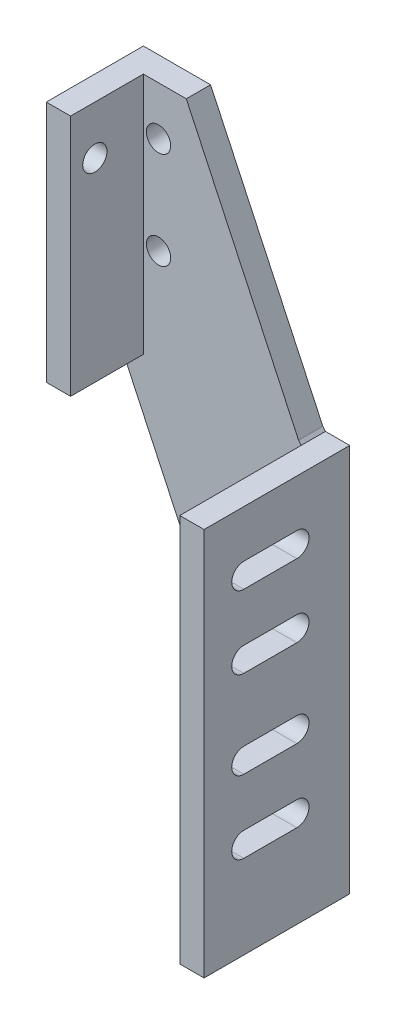
ISO-10303-21;
HEADER;
FILE_DESCRIPTION(('STEP AP214'),'2;1');
FILE_NAME('part.step','',(''),(''),'','','');
FILE_SCHEMA(('AUTOMOTIVE_DESIGN { 1 0 10303 214 1 1 1 1 }'));
ENDSEC;
DATA;
#1=APPLICATION_CONTEXT('core data for automotive mechanical design processes');
#2=APPLICATION_PROTOCOL_DEFINITION('international standard','automotive_design',2000,#1);
#3=PRODUCT_CONTEXT('',#1,'mechanical');
#4=PRODUCT('Part','Part','',(#3));
#5=PRODUCT_RELATED_PRODUCT_CATEGORY('part','',(#4));
#6=PRODUCT_DEFINITION_FORMATION('','',#4);
#7=PRODUCT_DEFINITION_CONTEXT('part definition',#1,'design');
#8=PRODUCT_DEFINITION('design','',#6,#7);
#9=PRODUCT_DEFINITION_SHAPE('','',#8);
#10=(LENGTH_UNIT() NAMED_UNIT(*) SI_UNIT(.MILLI.,.METRE.));
#11=(NAMED_UNIT(*) PLANE_ANGLE_UNIT() SI_UNIT($,.RADIAN.));
#12=(NAMED_UNIT(*) SI_UNIT($,.STERADIAN.) SOLID_ANGLE_UNIT());
#13=UNCERTAINTY_MEASURE_WITH_UNIT(LENGTH_MEASURE(1.E-05),#10,'distance_accuracy_value','');
#14=(GEOMETRIC_REPRESENTATION_CONTEXT(3) GLOBAL_UNCERTAINTY_ASSIGNED_CONTEXT((#13)) GLOBAL_UNIT_ASSIGNED_CONTEXT((#10,
#11,#12)) REPRESENTATION_CONTEXT('',''));
#15=CARTESIAN_POINT('',(0.,0.,0.));
#16=DIRECTION('',(0.,0.,1.));
#17=DIRECTION('',(1.,0.,0.));
#18=AXIS2_PLACEMENT_3D('',#15,#16,#17);
#19=CARTESIAN_POINT('',(-106.588300915185,-1.66039880784868,12.7));
#20=DIRECTION('',(0.,0.,1.));
#21=DIRECTION('',(1.,0.,0.));
#22=AXIS2_PLACEMENT_3D('',#19,#20,#21);
#23=PLANE('',#22);
#24=CARTESIAN_POINT('',(-85.963500915185,99.9476380283201,12.7));
#25=DIRECTION('',(0.,0.,1.));
#26=DIRECTION('',(1.,0.,0.));
#27=AXIS2_PLACEMENT_3D('',#24,#25,#26);
#28=CIRCLE('',#27,6.34999999999999);
#29=CARTESIAN_POINT('',(-79.613500915185,99.9476380283201,12.7));
#30=VERTEX_POINT('',#29);
#31=EDGE_CURVE('E49',#30,#30,#28,.T.);
#32=ORIENTED_EDGE('',*,*,#31,.F.);
#33=EDGE_LOOP('',(#32));
#34=FACE_BOUND('',#33,.T.);
#35=CARTESIAN_POINT('',(-85.963500915185,49.1476380283201,12.7));
#36=DIRECTION('',(0.,0.,1.));
#37=DIRECTION('',(1.,0.,0.));
#38=AXIS2_PLACEMENT_3D('',#35,#36,#37);
#39=CIRCLE('',#38,6.34999999999999);
#40=CARTESIAN_POINT('',(-79.613500915185,49.1476380283201,12.7));
#41=VERTEX_POINT('',#40);
#42=EDGE_CURVE('E364',#41,#41,#39,.T.);
#43=ORIENTED_EDGE('',*,*,#42,.F.);
#44=EDGE_LOOP('',(#43));
#45=FACE_BOUND('',#44,.T.);
#46=DIRECTION('',(0.424357467855112,-0.905494748452799,0.));
#47=VECTOR('',#46,1.);
#48=CARTESIAN_POINT('',(-106.588300915185,-1.65236197167989,12.7));
#49=LINE('',#48,#47);
#50=CARTESIAN_POINT('',(-106.588300915185,-1.65236197167989,12.7));
#51=VERTEX_POINT('',#50);
#52=CARTESIAN_POINT('',(-11.355448259828,-204.860398807849,12.7));
#53=VERTEX_POINT('',#52);
#54=EDGE_CURVE('E429',#51,#53,#49,.T.);
#55=ORIENTED_EDGE('',*,*,#54,.T.);
#56=DIRECTION('',(0.,-1.,0.));
#57=VECTOR('',#56,1.);
#58=CARTESIAN_POINT('',(-11.355448259828,-204.860398807849,12.7));
#59=LINE('',#58,#57);
#60=CARTESIAN_POINT('',(-11.355448259828,-1.66039880784869,12.7));
#61=VERTEX_POINT('',#60);
#62=EDGE_CURVE('E371',#61,#53,#59,.T.);
#63=ORIENTED_EDGE('',*,*,#62,.F.);
#64=DIRECTION('',(-0.62931680009807,0.77714886933864,0.));
#65=VECTOR('',#64,1.);
#66=CARTESIAN_POINT('',(-11.355448259828,-1.66039880784869,12.7));
#67=LINE('',#66,#65);
#68=CARTESIAN_POINT('',(-12.7,0.,12.7));
#69=VERTEX_POINT('',#68);
#70=EDGE_CURVE('E475',#61,#69,#67,.T.);
#71=ORIENTED_EDGE('',*,*,#70,.T.);
#72=DIRECTION('',(-0.424357467855125,0.905494748452793,0.));
#73=VECTOR('',#72,1.);
#74=CARTESIAN_POINT('',(-12.7,0.,12.7));
#75=LINE('',#74,#73);
#76=CARTESIAN_POINT('',(-71.443804275185,125.34763802832,12.7));
#77=VERTEX_POINT('',#76);
#78=EDGE_CURVE('E477',#69,#77,#75,.T.);
#79=ORIENTED_EDGE('',*,*,#78,.T.);
#80=DIRECTION('',(-1.,0.,0.));
#81=VECTOR('',#80,1.);
#82=CARTESIAN_POINT('',(-71.443804275185,125.34763802832,12.7));
#83=LINE('',#82,#81);
#84=CARTESIAN_POINT('',(-93.888300915185,125.34763802832,12.7));
#85=VERTEX_POINT('',#84);
#86=EDGE_CURVE('E413',#77,#85,#83,.T.);
#87=ORIENTED_EDGE('',*,*,#86,.T.);
#88=DIRECTION('',(0.,1.,0.));
#89=VECTOR('',#88,1.);
#90=CARTESIAN_POINT('',(-93.888300915185,125.34763802832,12.7));
#91=LINE('',#90,#89);
#92=CARTESIAN_POINT('',(-93.888300915185,-1.65236197167989,12.7));
#93=VERTEX_POINT('',#92);
#94=EDGE_CURVE('E395',#93,#85,#91,.T.);
#95=ORIENTED_EDGE('',*,*,#94,.F.);
#96=DIRECTION('',(1.,0.,0.));
#97=VECTOR('',#96,1.);
#98=CARTESIAN_POINT('',(-106.588300915185,-1.65236197167989,12.7));
#99=LINE('',#98,#97);
#100=EDGE_CURVE('E390',#51,#93,#99,.T.);
#101=ORIENTED_EDGE('',*,*,#100,.F.);
#102=EDGE_LOOP('',(#55,#63,#71,#79,#87,#95,#101));
#103=FACE_BOUND('',#102,.T.);
#104=ADVANCED_FACE('F45',(#34,#45,#103),#23,.T.);
#105=CARTESIAN_POINT('',(1.34455174017202,-1.66039880784868,12.7));
#106=DIRECTION('',(0.,-1.,0.));
#107=DIRECTION('',(1.,0.,0.));
#108=AXIS2_PLACEMENT_3D('',#105,#106,#107);
#109=PLANE('',#108);
#110=DIRECTION('',(-1.,0.,0.));
#111=VECTOR('',#110,1.);
#112=CARTESIAN_POINT('',(1.34455174017202,-1.66039880784868,0.));
#113=LINE('',#112,#111);
#114=CARTESIAN_POINT('',(1.34455174017202,-1.66039880784868,0.));
#115=VERTEX_POINT('',#114);
#116=CARTESIAN_POINT('',(-11.355448259828,-1.66039880784869,0.));
#117=VERTEX_POINT('',#116);
#118=EDGE_CURVE('E469',#115,#117,#113,.T.);
#119=ORIENTED_EDGE('',*,*,#118,.T.);
#120=DIRECTION('',(0.,0.,-1.));
#121=VECTOR('',#120,1.);
#122=CARTESIAN_POINT('',(-11.355448259828,-1.66039880784869,12.7));
#123=LINE('',#122,#121);
#124=EDGE_CURVE('E13',#61,#117,#123,.T.);
#125=ORIENTED_EDGE('',*,*,#124,.F.);
#126=DIRECTION('',(0.,0.,-1.));
#127=VECTOR('',#126,1.);
#128=CARTESIAN_POINT('',(-11.355448259828,-1.66039880784869,76.2));
#129=LINE('',#128,#127);
#130=CARTESIAN_POINT('',(-11.355448259828,-1.66039880784869,76.2));
#131=VERTEX_POINT('',#130);
#132=EDGE_CURVE('E387',#131,#61,#129,.T.);
#133=ORIENTED_EDGE('',*,*,#132,.F.);
#134=DIRECTION('',(-1.,0.,0.));
#135=VECTOR('',#134,1.);
#136=CARTESIAN_POINT('',(1.34455174017202,-1.66039880784869,76.2));
#137=LINE('',#136,#135);
#138=CARTESIAN_POINT('',(1.34455174017202,-1.66039880784869,76.2));
#139=VERTEX_POINT('',#138);
#140=EDGE_CURVE('E375',#139,#131,#137,.T.);
#141=ORIENTED_EDGE('',*,*,#140,.F.);
#142=DIRECTION('',(0.,0.,-1.));
#143=VECTOR('',#142,1.);
#144=CARTESIAN_POINT('',(1.34455174017202,-1.66039880784868,12.7));
#145=LINE('',#144,#143);
#146=EDGE_CURVE('E436',#139,#115,#145,.T.);
#147=ORIENTED_EDGE('',*,*,#146,.T.);
#148=EDGE_LOOP('',(#119,#125,#133,#141,#147));
#149=FACE_BOUND('',#148,.T.);
#150=ADVANCED_FACE('F47',(#149),#109,.F.);
#151=CARTESIAN_POINT('',(-11.355448259828,-1.66039880784869,12.7));
#152=DIRECTION('',(-0.77714886933864,-0.629316800098069,0.));
#153=DIRECTION('',(0.62931680009807,-0.77714886933864,0.));
#154=AXIS2_PLACEMENT_3D('',#151,#152,#153);
#155=PLANE('',#154);
#156=DIRECTION('',(-0.62931680009807,0.77714886933864,0.));
#157=VECTOR('',#156,1.);
#158=CARTESIAN_POINT('',(-11.355448259828,-1.66039880784869,0.));
#159=LINE('',#158,#157);
#160=CARTESIAN_POINT('',(-12.7,0.,0.));
#161=VERTEX_POINT('',#160);
#162=EDGE_CURVE('E473',#117,#161,#159,.T.);
#163=ORIENTED_EDGE('',*,*,#162,.T.);
#164=DIRECTION('',(0.,0.,-1.));
#165=VECTOR('',#164,1.);
#166=CARTESIAN_POINT('',(-12.7,0.,12.7));
#167=LINE('',#166,#165);
#168=EDGE_CURVE('E54',#69,#161,#167,.T.);
#169=ORIENTED_EDGE('',*,*,#168,.F.);
#170=ORIENTED_EDGE('',*,*,#70,.F.);
#171=ORIENTED_EDGE('',*,*,#124,.T.);
#172=EDGE_LOOP('',(#163,#169,#170,#171));
#173=FACE_BOUND('',#172,.T.);
#174=ADVANCED_FACE('F471',(#173),#155,.F.);
#175=CARTESIAN_POINT('',(-12.7,0.,12.7));
#176=DIRECTION('',(-0.905494748452793,-0.424357467855125,0.));
#177=DIRECTION('',(0.424357467855125,-0.905494748452793,0.));
#178=AXIS2_PLACEMENT_3D('',#175,#176,#177);
#179=PLANE('',#178);
#180=DIRECTION('',(-0.424357467855125,0.905494748452793,0.));
#181=VECTOR('',#180,1.);
#182=CARTESIAN_POINT('',(-12.7,0.,0.));
#183=LINE('',#182,#181);
#184=CARTESIAN_POINT('',(-71.443804275185,125.34763802832,0.));
#185=VERTEX_POINT('',#184);
#186=EDGE_CURVE('E487',#161,#185,#183,.T.);
#187=ORIENTED_EDGE('',*,*,#186,.T.);
#188=DIRECTION('',(0.,0.,-1.));
#189=VECTOR('',#188,1.);
#190=CARTESIAN_POINT('',(-71.443804275185,125.34763802832,12.7));
#191=LINE('',#190,#189);
#192=EDGE_CURVE('E500',#77,#185,#191,.T.);
#193=ORIENTED_EDGE('',*,*,#192,.F.);
#194=ORIENTED_EDGE('',*,*,#78,.F.);
#195=ORIENTED_EDGE('',*,*,#168,.T.);
#196=EDGE_LOOP('',(#187,#193,#194,#195));
#197=FACE_BOUND('',#196,.T.);
#198=ADVANCED_FACE('F505',(#197),#179,.F.);
#199=CARTESIAN_POINT('',(-71.443804275185,125.34763802832,12.7));
#200=DIRECTION('',(0.,-1.,0.));
#201=DIRECTION('',(0.,0.,-1.));
#202=AXIS2_PLACEMENT_3D('',#199,#200,#201);
#203=PLANE('',#202);
#204=DIRECTION('',(-1.,0.,0.));
#205=VECTOR('',#204,1.);
#206=CARTESIAN_POINT('',(-71.443804275185,125.34763802832,0.));
#207=LINE('',#206,#205);
#208=CARTESIAN_POINT('',(-106.588300915185,125.34763802832,0.));
#209=VERTEX_POINT('',#208);
#210=EDGE_CURVE('E489',#185,#209,#207,.T.);
#211=ORIENTED_EDGE('',*,*,#210,.T.);
#212=DIRECTION('',(0.,0.,-1.));
#213=VECTOR('',#212,1.);
#214=CARTESIAN_POINT('',(-106.588300915185,125.34763802832,12.7));
#215=LINE('',#214,#213);
#216=CARTESIAN_POINT('',(-106.588300915185,125.34763802832,50.8));
#217=VERTEX_POINT('',#216);
#218=EDGE_CURVE('E497',#217,#209,#215,.T.);
#219=ORIENTED_EDGE('',*,*,#218,.F.);
#220=DIRECTION('',(-1.,0.,0.));
#221=VECTOR('',#220,1.);
#222=CARTESIAN_POINT('',(-106.588300915185,125.34763802832,50.8));
#223=LINE('',#222,#221);
#224=CARTESIAN_POINT('',(-93.888300915185,125.34763802832,50.8));
#225=VERTEX_POINT('',#224);
#226=EDGE_CURVE('E399',#225,#217,#223,.T.);
#227=ORIENTED_EDGE('',*,*,#226,.F.);
#228=DIRECTION('',(0.,0.,-1.));
#229=VECTOR('',#228,1.);
#230=CARTESIAN_POINT('',(-93.888300915185,125.34763802832,50.8));
#231=LINE('',#230,#229);
#232=EDGE_CURVE('E402',#225,#85,#231,.T.);
#233=ORIENTED_EDGE('',*,*,#232,.T.);
#234=ORIENTED_EDGE('',*,*,#86,.F.);
#235=ORIENTED_EDGE('',*,*,#192,.T.);
#236=EDGE_LOOP('',(#211,#219,#227,#233,#234,#235));
#237=FACE_BOUND('',#236,.T.);
#238=ADVANCED_FACE('F512',(#237),#203,.F.);
#239=CARTESIAN_POINT('',(-106.588300915185,125.34763802832,12.7));
#240=DIRECTION('',(1.,0.,0.));
#241=DIRECTION('',(0.,1.,0.));
#242=AXIS2_PLACEMENT_3D('',#239,#240,#241);
#243=PLANE('',#242);
#244=CARTESIAN_POINT('',(-106.588300915185,99.9476380283201,38.1));
#245=DIRECTION('',(-1.,0.,0.));
#246=DIRECTION('',(0.,0.,1.));
#247=AXIS2_PLACEMENT_3D('',#244,#245,#246);
#248=CIRCLE('',#247,6.34999999999999);
#249=CARTESIAN_POINT('',(-106.588300915185,99.9476380283201,44.45));
#250=VERTEX_POINT('',#249);
#251=EDGE_CURVE('E365',#250,#250,#248,.T.);
#252=ORIENTED_EDGE('',*,*,#251,.F.);
#253=EDGE_LOOP('',(#252));
#254=FACE_BOUND('',#253,.T.);
#255=DIRECTION('',(0.,-1.,0.));
#256=VECTOR('',#255,1.);
#257=CARTESIAN_POINT('',(-106.588300915185,125.34763802832,0.));
#258=LINE('',#257,#256);
#259=CARTESIAN_POINT('',(-106.588300915185,-1.65236197167989,0.));
#260=VERTEX_POINT('',#259);
#261=EDGE_CURVE('E491',#209,#260,#258,.T.);
#262=ORIENTED_EDGE('',*,*,#261,.T.);
#263=DIRECTION('',(0.,0.,-1.));
#264=VECTOR('',#263,1.);
#265=CARTESIAN_POINT('',(-106.588300915185,-1.65236197167989,12.7));
#266=LINE('',#265,#264);
#267=EDGE_CURVE('E445',#51,#260,#266,.T.);
#268=ORIENTED_EDGE('',*,*,#267,.F.);
#269=DIRECTION('',(0.,0.,-1.));
#270=VECTOR('',#269,1.);
#271=CARTESIAN_POINT('',(-106.588300915185,-1.65236197167989,50.8));
#272=LINE('',#271,#270);
#273=CARTESIAN_POINT('',(-106.588300915185,-1.65236197167989,50.8));
#274=VERTEX_POINT('',#273);
#275=EDGE_CURVE('E482',#274,#51,#272,.T.);
#276=ORIENTED_EDGE('',*,*,#275,.F.);
#277=DIRECTION('',(0.,-1.,0.));
#278=VECTOR('',#277,1.);
#279=CARTESIAN_POINT('',(-106.588300915185,125.34763802832,50.8));
#280=LINE('',#279,#278);
#281=EDGE_CURVE('E391',#217,#274,#280,.T.);
#282=ORIENTED_EDGE('',*,*,#281,.F.);
#283=ORIENTED_EDGE('',*,*,#218,.T.);
#284=EDGE_LOOP('',(#262,#268,#276,#282,#283));
#285=FACE_BOUND('',#284,.T.);
#286=ADVANCED_FACE('F517',(#254,#285),#243,.F.);
#287=CARTESIAN_POINT('',(-106.588300915185,-1.65236197167989,12.7));
#288=DIRECTION('',(0.905494748452799,0.424357467855112,0.));
#289=DIRECTION('',(-0.424357467855112,0.905494748452799,0.));
#290=AXIS2_PLACEMENT_3D('',#287,#288,#289);
#291=PLANE('',#290);
#292=DIRECTION('',(0.424357467855112,-0.905494748452799,0.));
#293=VECTOR('',#292,1.);
#294=CARTESIAN_POINT('',(-106.588300915185,-1.65236197167989,0.));
#295=LINE('',#294,#293);
#296=CARTESIAN_POINT('',(-11.355448259828,-204.860398807849,0.));
#297=VERTEX_POINT('',#296);
#298=EDGE_CURVE('E442',#260,#297,#295,.T.);
#299=ORIENTED_EDGE('',*,*,#298,.T.);
#300=DIRECTION('',(0.,0.,-1.));
#301=VECTOR('',#300,1.);
#302=CARTESIAN_POINT('',(-11.355448259828,-204.860398807849,12.7));
#303=LINE('',#302,#301);
#304=EDGE_CURVE('E439',#53,#297,#303,.T.);
#305=ORIENTED_EDGE('',*,*,#304,.F.);
#306=ORIENTED_EDGE('',*,*,#54,.F.);
#307=ORIENTED_EDGE('',*,*,#267,.T.);
#308=EDGE_LOOP('',(#299,#305,#306,#307));
#309=FACE_BOUND('',#308,.T.);
#310=ADVANCED_FACE('F440',(#309),#291,.F.);
#311=CARTESIAN_POINT('',(-11.355448259828,-204.860398807849,12.7));
#312=DIRECTION('',(0.,1.,0.));
#313=DIRECTION('',(0.,0.,1.));
#314=AXIS2_PLACEMENT_3D('',#311,#312,#313);
#315=PLANE('',#314);
#316=DIRECTION('',(1.,0.,0.));
#317=VECTOR('',#316,1.);
#318=CARTESIAN_POINT('',(-11.355448259828,-204.860398807849,0.));
#319=LINE('',#318,#317);
#320=CARTESIAN_POINT('',(1.34455174017202,-204.860398807849,0.));
#321=VERTEX_POINT('',#320);
#322=EDGE_CURVE('E480',#297,#321,#319,.T.);
#323=ORIENTED_EDGE('',*,*,#322,.T.);
#324=DIRECTION('',(0.,0.,-1.));
#325=VECTOR('',#324,1.);
#326=CARTESIAN_POINT('',(1.34455174017202,-204.860398807849,12.7));
#327=LINE('',#326,#325);
#328=CARTESIAN_POINT('',(1.34455174017202,-204.860398807849,76.2));
#329=VERTEX_POINT('',#328);
#330=EDGE_CURVE('E446',#329,#321,#327,.T.);
#331=ORIENTED_EDGE('',*,*,#330,.F.);
#332=DIRECTION('',(1.,0.,0.));
#333=VECTOR('',#332,1.);
#334=CARTESIAN_POINT('',(1.34455174017202,-204.860398807849,76.2));
#335=LINE('',#334,#333);
#336=CARTESIAN_POINT('',(-11.355448259828,-204.860398807849,76.2));
#337=VERTEX_POINT('',#336);
#338=EDGE_CURVE('E379',#337,#329,#335,.T.);
#339=ORIENTED_EDGE('',*,*,#338,.F.);
#340=DIRECTION('',(0.,0.,-1.));
#341=VECTOR('',#340,1.);
#342=CARTESIAN_POINT('',(-11.355448259828,-204.860398807849,76.2));
#343=LINE('',#342,#341);
#344=EDGE_CURVE('E382',#337,#53,#343,.T.);
#345=ORIENTED_EDGE('',*,*,#344,.T.);
#346=ORIENTED_EDGE('',*,*,#304,.T.);
#347=EDGE_LOOP('',(#323,#331,#339,#345,#346));
#348=FACE_BOUND('',#347,.T.);
#349=ADVANCED_FACE('F453',(#348),#315,.F.);
#350=CARTESIAN_POINT('',(1.34455174017202,-204.860398807849,12.7));
#351=DIRECTION('',(-1.,0.,0.));
#352=DIRECTION('',(0.,0.,1.));
#353=AXIS2_PLACEMENT_3D('',#350,#351,#352);
#354=PLANE('',#353);
#355=DIRECTION('',(0.,0.,-1.));
#356=VECTOR('',#355,1.);
#357=CARTESIAN_POINT('',(1.34455174017202,-122.945398807849,27.6450635819993));
#358=LINE('',#357,#356);
#359=CARTESIAN_POINT('',(1.34455174017202,-122.945398807849,55.3719999999992));
#360=VERTEX_POINT('',#359);
#361=CARTESIAN_POINT('',(1.34455174017202,-122.945398807849,27.6450635819993));
#362=VERTEX_POINT('',#361);
#363=EDGE_CURVE('E251',#360,#362,#358,.T.);
#364=ORIENTED_EDGE('',*,*,#363,.F.);
#365=CARTESIAN_POINT('',(1.34455174017202,-116.595398807849,55.3719999999993));
#366=DIRECTION('',(1.,0.,0.));
#367=DIRECTION('',(0.,0.,-1.));
#368=AXIS2_PLACEMENT_3D('',#365,#366,#367);
#369=CIRCLE('',#368,6.34999999999999);
#370=CARTESIAN_POINT('',(1.34455174017202,-110.245398807849,55.3719999999993));
#371=VERTEX_POINT('',#370);
#372=EDGE_CURVE('E62',#371,#360,#369,.T.);
#373=ORIENTED_EDGE('',*,*,#372,.F.);
#374=DIRECTION('',(0.,0.,1.));
#375=VECTOR('',#374,1.);
#376=CARTESIAN_POINT('',(1.34455174017202,-110.245398807849,55.3719999999993));
#377=LINE('',#376,#375);
#378=CARTESIAN_POINT('',(1.34455174017202,-110.245398807849,27.6450635819993));
#379=VERTEX_POINT('',#378);
#380=EDGE_CURVE('E237',#379,#371,#377,.T.);
#381=ORIENTED_EDGE('',*,*,#380,.F.);
#382=CARTESIAN_POINT('',(1.34455174017202,-116.595398807849,27.6450635819993));
#383=DIRECTION('',(1.,0.,0.));
#384=DIRECTION('',(0.,0.,-1.));
#385=AXIS2_PLACEMENT_3D('',#382,#383,#384);
#386=CIRCLE('',#385,6.34999999999999);
#387=EDGE_CURVE('E257',#362,#379,#386,.T.);
#388=ORIENTED_EDGE('',*,*,#387,.F.);
#389=EDGE_LOOP('',(#364,#373,#381,#388));
#390=FACE_BOUND('',#389,.T.);
#391=DIRECTION('',(0.,0.,-1.));
#392=VECTOR('',#391,1.);
#393=CARTESIAN_POINT('',(1.34455174017202,-161.045398807849,27.6450635819991));
#394=LINE('',#393,#392);
#395=CARTESIAN_POINT('',(1.34455174017202,-161.045398807849,55.3719999999991));
#396=VERTEX_POINT('',#395);
#397=CARTESIAN_POINT('',(1.34455174017202,-161.045398807849,27.6450635819991));
#398=VERTEX_POINT('',#397);
#399=EDGE_CURVE('E275',#396,#398,#394,.T.);
#400=ORIENTED_EDGE('',*,*,#399,.F.);
#401=CARTESIAN_POINT('',(1.34455174017202,-154.695398807849,55.3719999999991));
#402=DIRECTION('',(1.,0.,0.));
#403=DIRECTION('',(0.,0.,-1.));
#404=AXIS2_PLACEMENT_3D('',#401,#402,#403);
#405=CIRCLE('',#404,6.34999999999999);
#406=CARTESIAN_POINT('',(1.34455174017202,-148.345398807849,55.3719999999991));
#407=VERTEX_POINT('',#406);
#408=EDGE_CURVE('E273',#407,#396,#405,.T.);
#409=ORIENTED_EDGE('',*,*,#408,.F.);
#410=DIRECTION('',(0.,0.,1.));
#411=VECTOR('',#410,1.);
#412=CARTESIAN_POINT('',(1.34455174017202,-148.345398807849,55.3719999999991));
#413=LINE('',#412,#411);
#414=CARTESIAN_POINT('',(1.34455174017202,-148.345398807849,27.6450635819991));
#415=VERTEX_POINT('',#414);
#416=EDGE_CURVE('E281',#415,#407,#413,.T.);
#417=ORIENTED_EDGE('',*,*,#416,.F.);
#418=CARTESIAN_POINT('',(1.34455174017202,-154.695398807849,27.6450635819991));
#419=DIRECTION('',(1.,0.,0.));
#420=DIRECTION('',(0.,0.,-1.));
#421=AXIS2_PLACEMENT_3D('',#418,#419,#420);
#422=CIRCLE('',#421,6.34999999999999);
#423=EDGE_CURVE('E278',#398,#415,#422,.T.);
#424=ORIENTED_EDGE('',*,*,#423,.F.);
#425=EDGE_LOOP('',(#400,#409,#417,#424));
#426=FACE_BOUND('',#425,.T.);
#427=DIRECTION('',(0.,0.,-1.));
#428=VECTOR('',#427,1.);
#429=CARTESIAN_POINT('',(1.34455174017202,-39.1253988078487,27.6450635820001));
#430=LINE('',#429,#428);
#431=CARTESIAN_POINT('',(1.34455174017202,-39.1253988078487,55.3720000000001));
#432=VERTEX_POINT('',#431);
#433=CARTESIAN_POINT('',(1.34455174017202,-39.1253988078487,27.6450635820002));
#434=VERTEX_POINT('',#433);
#435=EDGE_CURVE('E306',#432,#434,#430,.T.);
#436=ORIENTED_EDGE('',*,*,#435,.F.);
#437=CARTESIAN_POINT('',(1.34455174017202,-32.7753988078487,55.3720000000001));
#438=DIRECTION('',(1.,0.,0.));
#439=DIRECTION('',(0.,0.,-1.));
#440=AXIS2_PLACEMENT_3D('',#437,#438,#439);
#441=CIRCLE('',#440,6.34999999999999);
#442=CARTESIAN_POINT('',(1.34455174017202,-26.4253988078487,55.3720000000001));
#443=VERTEX_POINT('',#442);
#444=EDGE_CURVE('E304',#443,#432,#441,.T.);
#445=ORIENTED_EDGE('',*,*,#444,.F.);
#446=DIRECTION('',(0.,0.,1.));
#447=VECTOR('',#446,1.);
#448=CARTESIAN_POINT('',(1.34455174017202,-26.4253988078487,55.3720000000001));
#449=LINE('',#448,#447);
#450=CARTESIAN_POINT('',(1.34455174017202,-26.4253988078487,27.6450635820001));
#451=VERTEX_POINT('',#450);
#452=EDGE_CURVE('E312',#451,#443,#449,.T.);
#453=ORIENTED_EDGE('',*,*,#452,.F.);
#454=CARTESIAN_POINT('',(1.34455174017202,-32.7753988078487,27.6450635820001));
#455=DIRECTION('',(1.,0.,0.));
#456=DIRECTION('',(0.,0.,-1.));
#457=AXIS2_PLACEMENT_3D('',#454,#455,#456);
#458=CIRCLE('',#457,6.34999999999999);
#459=EDGE_CURVE('E309',#434,#451,#458,.T.);
#460=ORIENTED_EDGE('',*,*,#459,.F.);
#461=EDGE_LOOP('',(#436,#445,#453,#460));
#462=FACE_BOUND('',#461,.T.);
#463=DIRECTION('',(0.,0.,-1.));
#464=VECTOR('',#463,1.);
#465=CARTESIAN_POINT('',(1.34455174017202,-77.2253988078487,27.645063582));
#466=LINE('',#465,#464);
#467=CARTESIAN_POINT('',(1.34455174017202,-77.2253988078487,55.372));
#468=VERTEX_POINT('',#467);
#469=CARTESIAN_POINT('',(1.34455174017202,-77.2253988078487,27.645063582));
#470=VERTEX_POINT('',#469);
#471=EDGE_CURVE('E337',#468,#470,#466,.T.);
#472=ORIENTED_EDGE('',*,*,#471,.F.);
#473=CARTESIAN_POINT('',(1.34455174017202,-70.8753988078487,55.372));
#474=DIRECTION('',(1.,0.,0.));
#475=DIRECTION('',(0.,0.,-1.));
#476=AXIS2_PLACEMENT_3D('',#473,#474,#475);
#477=CIRCLE('',#476,6.34999999999999);
#478=CARTESIAN_POINT('',(1.34455174017202,-64.5253988078487,55.372));
#479=VERTEX_POINT('',#478);
#480=EDGE_CURVE('E335',#479,#468,#477,.T.);
#481=ORIENTED_EDGE('',*,*,#480,.F.);
#482=DIRECTION('',(0.,0.,1.));
#483=VECTOR('',#482,1.);
#484=CARTESIAN_POINT('',(1.34455174017202,-64.5253988078487,55.372));
#485=LINE('',#484,#483);
#486=CARTESIAN_POINT('',(1.34455174017202,-64.5253988078487,27.645063582));
#487=VERTEX_POINT('',#486);
#488=EDGE_CURVE('E343',#487,#479,#485,.T.);
#489=ORIENTED_EDGE('',*,*,#488,.F.);
#490=CARTESIAN_POINT('',(1.34455174017202,-70.8753988078487,27.645063582));
#491=DIRECTION('',(1.,0.,0.));
#492=DIRECTION('',(0.,0.,-1.));
#493=AXIS2_PLACEMENT_3D('',#490,#491,#492);
#494=CIRCLE('',#493,6.34999999999999);
#495=EDGE_CURVE('E340',#470,#487,#494,.T.);
#496=ORIENTED_EDGE('',*,*,#495,.F.);
#497=EDGE_LOOP('',(#472,#481,#489,#496));
#498=FACE_BOUND('',#497,.T.);
#499=DIRECTION('',(0.,1.,0.));
#500=VECTOR('',#499,1.);
#501=CARTESIAN_POINT('',(1.34455174017202,-204.860398807849,0.));
#502=LINE('',#501,#500);
#503=EDGE_CURVE('E463',#321,#115,#502,.T.);
#504=ORIENTED_EDGE('',*,*,#503,.T.);
#505=ORIENTED_EDGE('',*,*,#146,.F.);
#506=DIRECTION('',(0.,1.,0.));
#507=VECTOR('',#506,1.);
#508=CARTESIAN_POINT('',(1.34455174017202,-204.860398807849,76.2));
#509=LINE('',#508,#507);
#510=EDGE_CURVE('E372',#329,#139,#509,.T.);
#511=ORIENTED_EDGE('',*,*,#510,.F.);
#512=ORIENTED_EDGE('',*,*,#330,.T.);
#513=EDGE_LOOP('',(#504,#505,#511,#512));
#514=FACE_BOUND('',#513,.T.);
#515=ADVANCED_FACE('F459',(#390,#426,#462,#498,#514),#354,.F.);
#516=CARTESIAN_POINT('',(-106.588300915185,-1.66039880784868,0.));
#517=DIRECTION('',(0.,0.,1.));
#518=DIRECTION('',(1.,0.,0.));
#519=AXIS2_PLACEMENT_3D('',#516,#517,#518);
#520=PLANE('',#519);
#521=CARTESIAN_POINT('',(-85.963500915185,99.9476380283201,0.));
#522=DIRECTION('',(0.,0.,-1.));
#523=DIRECTION('',(-1.,0.,0.));
#524=AXIS2_PLACEMENT_3D('',#521,#522,#523);
#525=CIRCLE('',#524,6.34999999999999);
#526=CARTESIAN_POINT('',(-92.313500915185,99.9476380283201,0.));
#527=VERTEX_POINT('',#526);
#528=EDGE_CURVE('E358',#527,#527,#525,.T.);
#529=ORIENTED_EDGE('',*,*,#528,.F.);
#530=EDGE_LOOP('',(#529));
#531=FACE_BOUND('',#530,.T.);
#532=CARTESIAN_POINT('',(-85.963500915185,49.1476380283201,0.));
#533=DIRECTION('',(0.,0.,-1.));
#534=DIRECTION('',(-1.,0.,0.));
#535=AXIS2_PLACEMENT_3D('',#532,#533,#534);
#536=CIRCLE('',#535,6.34999999999999);
#537=CARTESIAN_POINT('',(-92.313500915185,49.1476380283201,0.));
#538=VERTEX_POINT('',#537);
#539=EDGE_CURVE('E361',#538,#538,#536,.T.);
#540=ORIENTED_EDGE('',*,*,#539,.F.);
#541=EDGE_LOOP('',(#540));
#542=FACE_BOUND('',#541,.T.);
#543=ORIENTED_EDGE('',*,*,#118,.F.);
#544=ORIENTED_EDGE('',*,*,#503,.F.);
#545=ORIENTED_EDGE('',*,*,#322,.F.);
#546=ORIENTED_EDGE('',*,*,#298,.F.);
#547=ORIENTED_EDGE('',*,*,#261,.F.);
#548=ORIENTED_EDGE('',*,*,#210,.F.);
#549=ORIENTED_EDGE('',*,*,#186,.F.);
#550=ORIENTED_EDGE('',*,*,#162,.F.);
#551=EDGE_LOOP('',(#543,#544,#545,#546,#547,#548,#549,#550));
#552=FACE_BOUND('',#551,.T.);
#553=ADVANCED_FACE('F509',(#531,#542,#552),#520,.F.);
#554=CARTESIAN_POINT('',(-106.588300915185,-1.65236197167989,50.8));
#555=DIRECTION('',(0.,1.,0.));
#556=DIRECTION('',(0.,0.,1.));
#557=AXIS2_PLACEMENT_3D('',#554,#555,#556);
#558=PLANE('',#557);
#559=ORIENTED_EDGE('',*,*,#100,.T.);
#560=DIRECTION('',(0.,0.,-1.));
#561=VECTOR('',#560,1.);
#562=CARTESIAN_POINT('',(-93.888300915185,-1.65236197167989,50.8));
#563=LINE('',#562,#561);
#564=CARTESIAN_POINT('',(-93.888300915185,-1.65236197167989,50.8));
#565=VERTEX_POINT('',#564);
#566=EDGE_CURVE('E407',#565,#93,#563,.T.);
#567=ORIENTED_EDGE('',*,*,#566,.F.);
#568=DIRECTION('',(1.,0.,0.));
#569=VECTOR('',#568,1.);
#570=CARTESIAN_POINT('',(-106.588300915185,-1.65236197167989,50.8));
#571=LINE('',#570,#569);
#572=EDGE_CURVE('E394',#274,#565,#571,.T.);
#573=ORIENTED_EDGE('',*,*,#572,.F.);
#574=ORIENTED_EDGE('',*,*,#275,.T.);
#575=EDGE_LOOP('',(#559,#567,#573,#574));
#576=FACE_BOUND('',#575,.T.);
#577=ADVANCED_FACE('F528',(#576),#558,.F.);
#578=CARTESIAN_POINT('',(-93.888300915185,125.34763802832,50.8));
#579=DIRECTION('',(-1.,0.,0.));
#580=DIRECTION('',(0.,-1.,0.));
#581=AXIS2_PLACEMENT_3D('',#578,#579,#580);
#582=PLANE('',#581);
#583=CARTESIAN_POINT('',(-93.888300915185,99.9476380283201,38.1));
#584=DIRECTION('',(-1.,0.,0.));
#585=DIRECTION('',(0.,-1.,0.));
#586=AXIS2_PLACEMENT_3D('',#583,#584,#585);
#587=CIRCLE('',#586,6.34999999999998);
#588=CARTESIAN_POINT('',(-93.888300915185,93.5976380283201,38.1));
#589=VERTEX_POINT('',#588);
#590=EDGE_CURVE('E368',#589,#589,#587,.T.);
#591=ORIENTED_EDGE('',*,*,#590,.T.);
#592=EDGE_LOOP('',(#591));
#593=FACE_BOUND('',#592,.T.);
#594=ORIENTED_EDGE('',*,*,#94,.T.);
#595=ORIENTED_EDGE('',*,*,#232,.F.);
#596=DIRECTION('',(0.,1.,0.));
#597=VECTOR('',#596,1.);
#598=CARTESIAN_POINT('',(-93.888300915185,125.34763802832,50.8));
#599=LINE('',#598,#597);
#600=EDGE_CURVE('E397',#565,#225,#599,.T.);
#601=ORIENTED_EDGE('',*,*,#600,.F.);
#602=ORIENTED_EDGE('',*,*,#566,.T.);
#603=EDGE_LOOP('',(#594,#595,#601,#602));
#604=FACE_BOUND('',#603,.T.);
#605=ADVANCED_FACE('F525',(#593,#604),#582,.F.);
#606=CARTESIAN_POINT('',(-106.588300915185,-1.65236197167989,50.8));
#607=DIRECTION('',(0.,0.,1.));
#608=DIRECTION('',(1.,0.,0.));
#609=AXIS2_PLACEMENT_3D('',#606,#607,#608);
#610=PLANE('',#609);
#611=ORIENTED_EDGE('',*,*,#281,.T.);
#612=ORIENTED_EDGE('',*,*,#572,.T.);
#613=ORIENTED_EDGE('',*,*,#600,.T.);
#614=ORIENTED_EDGE('',*,*,#226,.T.);
#615=EDGE_LOOP('',(#611,#612,#613,#614));
#616=FACE_BOUND('',#615,.T.);
#617=ADVANCED_FACE('F520',(#616),#610,.T.);
#618=CARTESIAN_POINT('',(-11.355448259828,-204.860398807849,76.2));
#619=DIRECTION('',(1.,0.,0.));
#620=DIRECTION('',(0.,0.,-1.));
#621=AXIS2_PLACEMENT_3D('',#618,#619,#620);
#622=PLANE('',#621);
#623=DIRECTION('',(0.,0.,-1.));
#624=VECTOR('',#623,1.);
#625=CARTESIAN_POINT('',(-11.355448259828,-110.245398807849,55.3719999999993));
#626=LINE('',#625,#624);
#627=CARTESIAN_POINT('',(-11.355448259828,-110.245398807849,55.3719999999993));
#628=VERTEX_POINT('',#627);
#629=CARTESIAN_POINT('',(-11.355448259828,-110.245398807849,27.6450635819993));
#630=VERTEX_POINT('',#629);
#631=EDGE_CURVE('E249',#628,#630,#626,.T.);
#632=ORIENTED_EDGE('',*,*,#631,.F.);
#633=CARTESIAN_POINT('',(-11.355448259828,-116.595398807849,55.3719999999993));
#634=DIRECTION('',(1.,0.,0.));
#635=DIRECTION('',(0.,0.,-1.));
#636=AXIS2_PLACEMENT_3D('',#633,#634,#635);
#637=CIRCLE('',#636,6.34999999999999);
#638=CARTESIAN_POINT('',(-11.355448259828,-122.945398807849,55.3719999999992));
#639=VERTEX_POINT('',#638);
#640=EDGE_CURVE('E231',#639,#628,#637,.F.);
#641=ORIENTED_EDGE('',*,*,#640,.F.);
#642=DIRECTION('',(0.,0.,1.));
#643=VECTOR('',#642,1.);
#644=CARTESIAN_POINT('',(-11.355448259828,-122.945398807849,27.6450635819993));
#645=LINE('',#644,#643);
#646=CARTESIAN_POINT('',(-11.355448259828,-122.945398807849,27.6450635819993));
#647=VERTEX_POINT('',#646);
#648=EDGE_CURVE('E240',#647,#639,#645,.T.);
#649=ORIENTED_EDGE('',*,*,#648,.F.);
#650=CARTESIAN_POINT('',(-11.355448259828,-116.595398807849,27.6450635819993));
#651=DIRECTION('',(1.,0.,0.));
#652=DIRECTION('',(0.,0.,-1.));
#653=AXIS2_PLACEMENT_3D('',#650,#651,#652);
#654=CIRCLE('',#653,6.34999999999999);
#655=EDGE_CURVE('E70',#630,#647,#654,.F.);
#656=ORIENTED_EDGE('',*,*,#655,.F.);
#657=EDGE_LOOP('',(#632,#641,#649,#656));
#658=FACE_BOUND('',#657,.T.);
#659=DIRECTION('',(0.,0.,-1.));
#660=VECTOR('',#659,1.);
#661=CARTESIAN_POINT('',(-11.355448259828,-148.345398807849,55.3719999999991));
#662=LINE('',#661,#660);
#663=CARTESIAN_POINT('',(-11.355448259828,-148.345398807849,55.3719999999991));
#664=VERTEX_POINT('',#663);
#665=CARTESIAN_POINT('',(-11.355448259828,-148.345398807849,27.6450635819991));
#666=VERTEX_POINT('',#665);
#667=EDGE_CURVE('E267',#664,#666,#662,.T.);
#668=ORIENTED_EDGE('',*,*,#667,.F.);
#669=CARTESIAN_POINT('',(-11.355448259828,-154.695398807849,55.3719999999991));
#670=DIRECTION('',(1.,0.,0.));
#671=DIRECTION('',(0.,0.,-1.));
#672=AXIS2_PLACEMENT_3D('',#669,#670,#671);
#673=CIRCLE('',#672,6.34999999999999);
#674=CARTESIAN_POINT('',(-11.355448259828,-161.045398807849,55.3719999999991));
#675=VERTEX_POINT('',#674);
#676=EDGE_CURVE('E270',#675,#664,#673,.F.);
#677=ORIENTED_EDGE('',*,*,#676,.F.);
#678=DIRECTION('',(0.,0.,1.));
#679=VECTOR('',#678,1.);
#680=CARTESIAN_POINT('',(-11.355448259828,-161.045398807849,27.6450635819991));
#681=LINE('',#680,#679);
#682=CARTESIAN_POINT('',(-11.355448259828,-161.045398807849,27.6450635819991));
#683=VERTEX_POINT('',#682);
#684=EDGE_CURVE('E287',#683,#675,#681,.T.);
#685=ORIENTED_EDGE('',*,*,#684,.F.);
#686=CARTESIAN_POINT('',(-11.355448259828,-154.695398807849,27.6450635819991));
#687=DIRECTION('',(1.,0.,0.));
#688=DIRECTION('',(0.,0.,-1.));
#689=AXIS2_PLACEMENT_3D('',#686,#687,#688);
#690=CIRCLE('',#689,6.34999999999999);
#691=EDGE_CURVE('E243',#666,#683,#690,.F.);
#692=ORIENTED_EDGE('',*,*,#691,.F.);
#693=EDGE_LOOP('',(#668,#677,#685,#692));
#694=FACE_BOUND('',#693,.T.);
#695=DIRECTION('',(0.,0.,-1.));
#696=VECTOR('',#695,1.);
#697=CARTESIAN_POINT('',(-11.355448259828,-26.4253988078487,55.3720000000001));
#698=LINE('',#697,#696);
#699=CARTESIAN_POINT('',(-11.355448259828,-26.4253988078487,55.3720000000001));
#700=VERTEX_POINT('',#699);
#701=CARTESIAN_POINT('',(-11.355448259828,-26.4253988078487,27.6450635820001));
#702=VERTEX_POINT('',#701);
#703=EDGE_CURVE('E298',#700,#702,#698,.T.);
#704=ORIENTED_EDGE('',*,*,#703,.F.);
#705=CARTESIAN_POINT('',(-11.355448259828,-32.7753988078487,55.3720000000001));
#706=DIRECTION('',(1.,0.,0.));
#707=DIRECTION('',(0.,0.,-1.));
#708=AXIS2_PLACEMENT_3D('',#705,#706,#707);
#709=CIRCLE('',#708,6.34999999999999);
#710=CARTESIAN_POINT('',(-11.355448259828,-39.1253988078487,55.3720000000001));
#711=VERTEX_POINT('',#710);
#712=EDGE_CURVE('E301',#711,#700,#709,.F.);
#713=ORIENTED_EDGE('',*,*,#712,.F.);
#714=DIRECTION('',(0.,0.,1.));
#715=VECTOR('',#714,1.);
#716=CARTESIAN_POINT('',(-11.355448259828,-39.1253988078487,27.6450635820001));
#717=LINE('',#716,#715);
#718=CARTESIAN_POINT('',(-11.355448259828,-39.1253988078487,27.6450635820002));
#719=VERTEX_POINT('',#718);
#720=EDGE_CURVE('E318',#719,#711,#717,.T.);
#721=ORIENTED_EDGE('',*,*,#720,.F.);
#722=CARTESIAN_POINT('',(-11.355448259828,-32.7753988078487,27.6450635820001));
#723=DIRECTION('',(1.,0.,0.));
#724=DIRECTION('',(0.,0.,-1.));
#725=AXIS2_PLACEMENT_3D('',#722,#723,#724);
#726=CIRCLE('',#725,6.34999999999999);
#727=EDGE_CURVE('E296',#702,#719,#726,.F.);
#728=ORIENTED_EDGE('',*,*,#727,.F.);
#729=EDGE_LOOP('',(#704,#713,#721,#728));
#730=FACE_BOUND('',#729,.T.);
#731=DIRECTION('',(0.,0.,-1.));
#732=VECTOR('',#731,1.);
#733=CARTESIAN_POINT('',(-11.355448259828,-64.5253988078487,55.372));
#734=LINE('',#733,#732);
#735=CARTESIAN_POINT('',(-11.355448259828,-64.5253988078487,55.372));
#736=VERTEX_POINT('',#735);
#737=CARTESIAN_POINT('',(-11.355448259828,-64.5253988078487,27.645063582));
#738=VERTEX_POINT('',#737);
#739=EDGE_CURVE('E329',#736,#738,#734,.T.);
#740=ORIENTED_EDGE('',*,*,#739,.F.);
#741=CARTESIAN_POINT('',(-11.355448259828,-70.8753988078487,55.372));
#742=DIRECTION('',(1.,0.,0.));
#743=DIRECTION('',(0.,0.,-1.));
#744=AXIS2_PLACEMENT_3D('',#741,#742,#743);
#745=CIRCLE('',#744,6.34999999999999);
#746=CARTESIAN_POINT('',(-11.355448259828,-77.2253988078487,55.372));
#747=VERTEX_POINT('',#746);
#748=EDGE_CURVE('E332',#747,#736,#745,.F.);
#749=ORIENTED_EDGE('',*,*,#748,.F.);
#750=DIRECTION('',(0.,0.,1.));
#751=VECTOR('',#750,1.);
#752=CARTESIAN_POINT('',(-11.355448259828,-77.2253988078487,27.645063582));
#753=LINE('',#752,#751);
#754=CARTESIAN_POINT('',(-11.355448259828,-77.2253988078487,27.645063582));
#755=VERTEX_POINT('',#754);
#756=EDGE_CURVE('E349',#755,#747,#753,.T.);
#757=ORIENTED_EDGE('',*,*,#756,.F.);
#758=CARTESIAN_POINT('',(-11.355448259828,-70.8753988078487,27.645063582));
#759=DIRECTION('',(1.,0.,0.));
#760=DIRECTION('',(0.,0.,-1.));
#761=AXIS2_PLACEMENT_3D('',#758,#759,#760);
#762=CIRCLE('',#761,6.34999999999999);
#763=EDGE_CURVE('E327',#738,#755,#762,.F.);
#764=ORIENTED_EDGE('',*,*,#763,.F.);
#765=EDGE_LOOP('',(#740,#749,#757,#764));
#766=FACE_BOUND('',#765,.T.);
#767=ORIENTED_EDGE('',*,*,#62,.T.);
#768=ORIENTED_EDGE('',*,*,#344,.F.);
#769=DIRECTION('',(0.,-1.,0.));
#770=VECTOR('',#769,1.);
#771=CARTESIAN_POINT('',(-11.355448259828,-204.860398807849,76.2));
#772=LINE('',#771,#770);
#773=EDGE_CURVE('E377',#131,#337,#772,.T.);
#774=ORIENTED_EDGE('',*,*,#773,.F.);
#775=ORIENTED_EDGE('',*,*,#132,.T.);
#776=EDGE_LOOP('',(#767,#768,#774,#775));
#777=FACE_BOUND('',#776,.T.);
#778=ADVANCED_FACE('F246',(#658,#694,#730,#766,#777),#622,.F.);
#779=CARTESIAN_POINT('',(1.34455174017202,-1.66039880784869,76.2));
#780=DIRECTION('',(0.,0.,1.));
#781=DIRECTION('',(1.,0.,0.));
#782=AXIS2_PLACEMENT_3D('',#779,#780,#781);
#783=PLANE('',#782);
#784=ORIENTED_EDGE('',*,*,#510,.T.);
#785=ORIENTED_EDGE('',*,*,#140,.T.);
#786=ORIENTED_EDGE('',*,*,#773,.T.);
#787=ORIENTED_EDGE('',*,*,#338,.T.);
#788=EDGE_LOOP('',(#784,#785,#786,#787));
#789=FACE_BOUND('',#788,.T.);
#790=ADVANCED_FACE('F457',(#789),#783,.T.);
#791=CARTESIAN_POINT('',(-106.588300915185,99.9476380283201,38.1));
#792=DIRECTION('',(-1.,0.,0.));
#793=DIRECTION('',(0.,0.,1.));
#794=AXIS2_PLACEMENT_3D('',#791,#792,#793);
#795=CYLINDRICAL_SURFACE('',#794,6.34999999999998);
#796=ORIENTED_EDGE('',*,*,#251,.T.);
#797=EDGE_LOOP('',(#796));
#798=FACE_BOUND('',#797,.T.);
#799=ORIENTED_EDGE('',*,*,#590,.F.);
#800=EDGE_LOOP('',(#799));
#801=FACE_BOUND('',#800,.T.);
#802=ADVANCED_FACE('F572',(#798,#801),#795,.F.);
#803=CARTESIAN_POINT('',(-85.963500915185,49.1476380283201,0.));
#804=DIRECTION('',(0.,0.,-1.));
#805=DIRECTION('',(-1.,0.,0.));
#806=AXIS2_PLACEMENT_3D('',#803,#804,#805);
#807=CYLINDRICAL_SURFACE('',#806,6.34999999999999);
#808=ORIENTED_EDGE('',*,*,#42,.T.);
#809=EDGE_LOOP('',(#808));
#810=FACE_BOUND('',#809,.T.);
#811=ORIENTED_EDGE('',*,*,#539,.T.);
#812=EDGE_LOOP('',(#811));
#813=FACE_BOUND('',#812,.T.);
#814=ADVANCED_FACE('F421',(#810,#813),#807,.F.);
#815=CARTESIAN_POINT('',(-85.963500915185,99.9476380283201,0.));
#816=DIRECTION('',(0.,0.,-1.));
#817=DIRECTION('',(-1.,0.,0.));
#818=AXIS2_PLACEMENT_3D('',#815,#816,#817);
#819=CYLINDRICAL_SURFACE('',#818,6.34999999999999);
#820=ORIENTED_EDGE('',*,*,#31,.T.);
#821=EDGE_LOOP('',(#820));
#822=FACE_BOUND('',#821,.T.);
#823=ORIENTED_EDGE('',*,*,#528,.T.);
#824=EDGE_LOOP('',(#823));
#825=FACE_BOUND('',#824,.T.);
#826=ADVANCED_FACE('F589',(#822,#825),#819,.F.);
#827=CARTESIAN_POINT('',(-106.589300915185,-70.8753988078487,55.372));
#828=DIRECTION('',(1.,0.,0.));
#829=DIRECTION('',(0.,0.,-1.));
#830=AXIS2_PLACEMENT_3D('',#827,#828,#829);
#831=CYLINDRICAL_SURFACE('',#830,6.34999999999999);
#832=ORIENTED_EDGE('',*,*,#748,.T.);
#833=DIRECTION('',(1.,0.,0.));
#834=VECTOR('',#833,1.);
#835=CARTESIAN_POINT('',(-106.589300915185,-64.5253988078487,55.372));
#836=LINE('',#835,#834);
#837=EDGE_CURVE('E347',#736,#479,#836,.T.);
#838=ORIENTED_EDGE('',*,*,#837,.T.);
#839=ORIENTED_EDGE('',*,*,#480,.T.);
#840=DIRECTION('',(1.,0.,0.));
#841=VECTOR('',#840,1.);
#842=CARTESIAN_POINT('',(-106.589300915185,-77.2253988078487,55.372));
#843=LINE('',#842,#841);
#844=EDGE_CURVE('E346',#747,#468,#843,.T.);
#845=ORIENTED_EDGE('',*,*,#844,.F.);
#846=EDGE_LOOP('',(#832,#838,#839,#845));
#847=FACE_BOUND('',#846,.T.);
#848=ADVANCED_FACE('F598',(#847),#831,.F.);
#849=CARTESIAN_POINT('',(-106.589300915185,-64.5253988078487,55.372));
#850=DIRECTION('',(0.,1.,0.));
#851=DIRECTION('',(0.,0.,1.));
#852=AXIS2_PLACEMENT_3D('',#849,#850,#851);
#853=PLANE('',#852);
#854=ORIENTED_EDGE('',*,*,#739,.T.);
#855=DIRECTION('',(1.,0.,0.));
#856=VECTOR('',#855,1.);
#857=CARTESIAN_POINT('',(-106.589300915185,-64.5253988078487,27.645063582));
#858=LINE('',#857,#856);
#859=EDGE_CURVE('E350',#738,#487,#858,.T.);
#860=ORIENTED_EDGE('',*,*,#859,.T.);
#861=ORIENTED_EDGE('',*,*,#488,.T.);
#862=ORIENTED_EDGE('',*,*,#837,.F.);
#863=EDGE_LOOP('',(#854,#860,#861,#862));
#864=FACE_BOUND('',#863,.T.);
#865=ADVANCED_FACE('F626',(#864),#853,.F.);
#866=CARTESIAN_POINT('',(-106.589300915185,-70.8753988078487,27.645063582));
#867=DIRECTION('',(1.,0.,0.));
#868=DIRECTION('',(0.,0.,-1.));
#869=AXIS2_PLACEMENT_3D('',#866,#867,#868);
#870=CYLINDRICAL_SURFACE('',#869,6.34999999999999);
#871=ORIENTED_EDGE('',*,*,#763,.T.);
#872=DIRECTION('',(1.,0.,0.));
#873=VECTOR('',#872,1.);
#874=CARTESIAN_POINT('',(-106.589300915185,-77.2253988078487,27.645063582));
#875=LINE('',#874,#873);
#876=EDGE_CURVE('E352',#755,#470,#875,.T.);
#877=ORIENTED_EDGE('',*,*,#876,.T.);
#878=ORIENTED_EDGE('',*,*,#495,.T.);
#879=ORIENTED_EDGE('',*,*,#859,.F.);
#880=EDGE_LOOP('',(#871,#877,#878,#879));
#881=FACE_BOUND('',#880,.T.);
#882=ADVANCED_FACE('F636',(#881),#870,.F.);
#883=CARTESIAN_POINT('',(-106.589300915185,-77.2253988078487,27.645063582));
#884=DIRECTION('',(0.,-1.,0.));
#885=DIRECTION('',(0.,0.,-1.));
#886=AXIS2_PLACEMENT_3D('',#883,#884,#885);
#887=PLANE('',#886);
#888=ORIENTED_EDGE('',*,*,#756,.T.);
#889=ORIENTED_EDGE('',*,*,#844,.T.);
#890=ORIENTED_EDGE('',*,*,#471,.T.);
#891=ORIENTED_EDGE('',*,*,#876,.F.);
#892=EDGE_LOOP('',(#888,#889,#890,#891));
#893=FACE_BOUND('',#892,.T.);
#894=ADVANCED_FACE('F646',(#893),#887,.F.);
#895=CARTESIAN_POINT('',(-106.589300915185,-32.7753988078487,55.3720000000001));
#896=DIRECTION('',(1.,0.,0.));
#897=DIRECTION('',(0.,0.,-1.));
#898=AXIS2_PLACEMENT_3D('',#895,#896,#897);
#899=CYLINDRICAL_SURFACE('',#898,6.34999999999999);
#900=ORIENTED_EDGE('',*,*,#712,.T.);
#901=DIRECTION('',(1.,0.,0.));
#902=VECTOR('',#901,1.);
#903=CARTESIAN_POINT('',(-106.589300915185,-26.4253988078487,55.3720000000001));
#904=LINE('',#903,#902);
#905=EDGE_CURVE('E316',#700,#443,#904,.T.);
#906=ORIENTED_EDGE('',*,*,#905,.T.);
#907=ORIENTED_EDGE('',*,*,#444,.T.);
#908=DIRECTION('',(1.,0.,0.));
#909=VECTOR('',#908,1.);
#910=CARTESIAN_POINT('',(-106.589300915185,-39.1253988078487,55.3720000000001));
#911=LINE('',#910,#909);
#912=EDGE_CURVE('E315',#711,#432,#911,.T.);
#913=ORIENTED_EDGE('',*,*,#912,.F.);
#914=EDGE_LOOP('',(#900,#906,#907,#913));
#915=FACE_BOUND('',#914,.T.);
#916=ADVANCED_FACE('F656',(#915),#899,.F.);
#917=CARTESIAN_POINT('',(-106.589300915185,-26.4253988078487,55.3720000000001));
#918=DIRECTION('',(0.,1.,0.));
#919=DIRECTION('',(0.,0.,1.));
#920=AXIS2_PLACEMENT_3D('',#917,#918,#919);
#921=PLANE('',#920);
#922=ORIENTED_EDGE('',*,*,#703,.T.);
#923=DIRECTION('',(1.,0.,0.));
#924=VECTOR('',#923,1.);
#925=CARTESIAN_POINT('',(-106.589300915185,-26.4253988078487,27.6450635820001));
#926=LINE('',#925,#924);
#927=EDGE_CURVE('E319',#702,#451,#926,.T.);
#928=ORIENTED_EDGE('',*,*,#927,.T.);
#929=ORIENTED_EDGE('',*,*,#452,.T.);
#930=ORIENTED_EDGE('',*,*,#905,.F.);
#931=EDGE_LOOP('',(#922,#928,#929,#930));
#932=FACE_BOUND('',#931,.T.);
#933=ADVANCED_FACE('F666',(#932),#921,.F.);
#934=CARTESIAN_POINT('',(-106.589300915185,-32.7753988078487,27.6450635820001));
#935=DIRECTION('',(1.,0.,0.));
#936=DIRECTION('',(0.,0.,-1.));
#937=AXIS2_PLACEMENT_3D('',#934,#935,#936);
#938=CYLINDRICAL_SURFACE('',#937,6.34999999999999);
#939=ORIENTED_EDGE('',*,*,#727,.T.);
#940=DIRECTION('',(1.,0.,0.));
#941=VECTOR('',#940,1.);
#942=CARTESIAN_POINT('',(-106.589300915185,-39.1253988078487,27.6450635820002));
#943=LINE('',#942,#941);
#944=EDGE_CURVE('E321',#719,#434,#943,.T.);
#945=ORIENTED_EDGE('',*,*,#944,.T.);
#946=ORIENTED_EDGE('',*,*,#459,.T.);
#947=ORIENTED_EDGE('',*,*,#927,.F.);
#948=EDGE_LOOP('',(#939,#945,#946,#947));
#949=FACE_BOUND('',#948,.T.);
#950=ADVANCED_FACE('F676',(#949),#938,.F.);
#951=CARTESIAN_POINT('',(-106.589300915185,-39.1253988078487,27.6450635820001));
#952=DIRECTION('',(0.,-1.,0.));
#953=DIRECTION('',(0.,0.,-1.));
#954=AXIS2_PLACEMENT_3D('',#951,#952,#953);
#955=PLANE('',#954);
#956=ORIENTED_EDGE('',*,*,#720,.T.);
#957=ORIENTED_EDGE('',*,*,#912,.T.);
#958=ORIENTED_EDGE('',*,*,#435,.T.);
#959=ORIENTED_EDGE('',*,*,#944,.F.);
#960=EDGE_LOOP('',(#956,#957,#958,#959));
#961=FACE_BOUND('',#960,.T.);
#962=ADVANCED_FACE('F686',(#961),#955,.F.);
#963=CARTESIAN_POINT('',(-106.589300915185,-154.695398807849,55.3719999999991));
#964=DIRECTION('',(1.,0.,0.));
#965=DIRECTION('',(0.,0.,-1.));
#966=AXIS2_PLACEMENT_3D('',#963,#964,#965);
#967=CYLINDRICAL_SURFACE('',#966,6.34999999999999);
#968=ORIENTED_EDGE('',*,*,#676,.T.);
#969=DIRECTION('',(1.,0.,0.));
#970=VECTOR('',#969,1.);
#971=CARTESIAN_POINT('',(-106.589300915185,-148.345398807849,55.3719999999991));
#972=LINE('',#971,#970);
#973=EDGE_CURVE('E285',#664,#407,#972,.T.);
#974=ORIENTED_EDGE('',*,*,#973,.T.);
#975=ORIENTED_EDGE('',*,*,#408,.T.);
#976=DIRECTION('',(1.,0.,0.));
#977=VECTOR('',#976,1.);
#978=CARTESIAN_POINT('',(-106.589300915185,-161.045398807849,55.3719999999991));
#979=LINE('',#978,#977);
#980=EDGE_CURVE('E284',#675,#396,#979,.T.);
#981=ORIENTED_EDGE('',*,*,#980,.F.);
#982=EDGE_LOOP('',(#968,#974,#975,#981));
#983=FACE_BOUND('',#982,.T.);
#984=ADVANCED_FACE('F696',(#983),#967,.F.);
#985=CARTESIAN_POINT('',(-106.589300915185,-148.345398807849,55.3719999999991));
#986=DIRECTION('',(0.,1.,0.));
#987=DIRECTION('',(0.,0.,1.));
#988=AXIS2_PLACEMENT_3D('',#985,#986,#987);
#989=PLANE('',#988);
#990=ORIENTED_EDGE('',*,*,#667,.T.);
#991=DIRECTION('',(1.,0.,0.));
#992=VECTOR('',#991,1.);
#993=CARTESIAN_POINT('',(-106.589300915185,-148.345398807849,27.6450635819991));
#994=LINE('',#993,#992);
#995=EDGE_CURVE('E288',#666,#415,#994,.T.);
#996=ORIENTED_EDGE('',*,*,#995,.T.);
#997=ORIENTED_EDGE('',*,*,#416,.T.);
#998=ORIENTED_EDGE('',*,*,#973,.F.);
#999=EDGE_LOOP('',(#990,#996,#997,#998));
#1000=FACE_BOUND('',#999,.T.);
#1001=ADVANCED_FACE('F706',(#1000),#989,.F.);
#1002=CARTESIAN_POINT('',(-106.589300915185,-154.695398807849,27.6450635819991));
#1003=DIRECTION('',(1.,0.,0.));
#1004=DIRECTION('',(0.,0.,-1.));
#1005=AXIS2_PLACEMENT_3D('',#1002,#1003,#1004);
#1006=CYLINDRICAL_SURFACE('',#1005,6.34999999999999);
#1007=ORIENTED_EDGE('',*,*,#691,.T.);
#1008=DIRECTION('',(1.,0.,0.));
#1009=VECTOR('',#1008,1.);
#1010=CARTESIAN_POINT('',(-106.589300915185,-161.045398807849,27.6450635819991));
#1011=LINE('',#1010,#1009);
#1012=EDGE_CURVE('E290',#683,#398,#1011,.T.);
#1013=ORIENTED_EDGE('',*,*,#1012,.T.);
#1014=ORIENTED_EDGE('',*,*,#423,.T.);
#1015=ORIENTED_EDGE('',*,*,#995,.F.);
#1016=EDGE_LOOP('',(#1007,#1013,#1014,#1015));
#1017=FACE_BOUND('',#1016,.T.);
#1018=ADVANCED_FACE('F716',(#1017),#1006,.F.);
#1019=CARTESIAN_POINT('',(-106.589300915185,-161.045398807849,27.6450635819991));
#1020=DIRECTION('',(0.,-1.,0.));
#1021=DIRECTION('',(0.,0.,-1.));
#1022=AXIS2_PLACEMENT_3D('',#1019,#1020,#1021);
#1023=PLANE('',#1022);
#1024=ORIENTED_EDGE('',*,*,#684,.T.);
#1025=ORIENTED_EDGE('',*,*,#980,.T.);
#1026=ORIENTED_EDGE('',*,*,#399,.T.);
#1027=ORIENTED_EDGE('',*,*,#1012,.F.);
#1028=EDGE_LOOP('',(#1024,#1025,#1026,#1027));
#1029=FACE_BOUND('',#1028,.T.);
#1030=ADVANCED_FACE('F726',(#1029),#1023,.F.);
#1031=CARTESIAN_POINT('',(-106.589300915185,-116.595398807849,55.3719999999993));
#1032=DIRECTION('',(1.,0.,0.));
#1033=DIRECTION('',(0.,0.,-1.));
#1034=AXIS2_PLACEMENT_3D('',#1031,#1032,#1033);
#1035=CYLINDRICAL_SURFACE('',#1034,6.34999999999999);
#1036=ORIENTED_EDGE('',*,*,#640,.T.);
#1037=DIRECTION('',(1.,0.,0.));
#1038=VECTOR('',#1037,1.);
#1039=CARTESIAN_POINT('',(-106.589300915185,-110.245398807849,55.3719999999993));
#1040=LINE('',#1039,#1038);
#1041=EDGE_CURVE('E244',#628,#371,#1040,.T.);
#1042=ORIENTED_EDGE('',*,*,#1041,.T.);
#1043=ORIENTED_EDGE('',*,*,#372,.T.);
#1044=DIRECTION('',(1.,0.,0.));
#1045=VECTOR('',#1044,1.);
#1046=CARTESIAN_POINT('',(-106.589300915185,-122.945398807849,55.3719999999992));
#1047=LINE('',#1046,#1045);
#1048=EDGE_CURVE('E227',#639,#360,#1047,.T.);
#1049=ORIENTED_EDGE('',*,*,#1048,.F.);
#1050=EDGE_LOOP('',(#1036,#1042,#1043,#1049));
#1051=FACE_BOUND('',#1050,.T.);
#1052=ADVANCED_FACE('F229',(#1051),#1035,.F.);
#1053=CARTESIAN_POINT('',(-106.589300915185,-110.245398807849,55.3719999999993));
#1054=DIRECTION('',(0.,1.,0.));
#1055=DIRECTION('',(0.,0.,1.));
#1056=AXIS2_PLACEMENT_3D('',#1053,#1054,#1055);
#1057=PLANE('',#1056);
#1058=ORIENTED_EDGE('',*,*,#631,.T.);
#1059=DIRECTION('',(1.,0.,0.));
#1060=VECTOR('',#1059,1.);
#1061=CARTESIAN_POINT('',(-106.589300915185,-110.245398807849,27.6450635819993));
#1062=LINE('',#1061,#1060);
#1063=EDGE_CURVE('E263',#630,#379,#1062,.T.);
#1064=ORIENTED_EDGE('',*,*,#1063,.T.);
#1065=ORIENTED_EDGE('',*,*,#380,.T.);
#1066=ORIENTED_EDGE('',*,*,#1041,.F.);
#1067=EDGE_LOOP('',(#1058,#1064,#1065,#1066));
#1068=FACE_BOUND('',#1067,.T.);
#1069=ADVANCED_FACE('F745',(#1068),#1057,.F.);
#1070=CARTESIAN_POINT('',(-106.589300915185,-116.595398807849,27.6450635819993));
#1071=DIRECTION('',(1.,0.,0.));
#1072=DIRECTION('',(0.,0.,-1.));
#1073=AXIS2_PLACEMENT_3D('',#1070,#1071,#1072);
#1074=CYLINDRICAL_SURFACE('',#1073,6.34999999999999);
#1075=ORIENTED_EDGE('',*,*,#655,.T.);
#1076=DIRECTION('',(1.,0.,0.));
#1077=VECTOR('',#1076,1.);
#1078=CARTESIAN_POINT('',(-106.589300915185,-122.945398807849,27.6450635819993));
#1079=LINE('',#1078,#1077);
#1080=EDGE_CURVE('E236',#647,#362,#1079,.T.);
#1081=ORIENTED_EDGE('',*,*,#1080,.T.);
#1082=ORIENTED_EDGE('',*,*,#387,.T.);
#1083=ORIENTED_EDGE('',*,*,#1063,.F.);
#1084=EDGE_LOOP('',(#1075,#1081,#1082,#1083));
#1085=FACE_BOUND('',#1084,.T.);
#1086=ADVANCED_FACE('F754',(#1085),#1074,.F.);
#1087=CARTESIAN_POINT('',(-106.589300915185,-122.945398807849,27.6450635819993));
#1088=DIRECTION('',(0.,-1.,0.));
#1089=DIRECTION('',(0.,0.,-1.));
#1090=AXIS2_PLACEMENT_3D('',#1087,#1088,#1089);
#1091=PLANE('',#1090);
#1092=ORIENTED_EDGE('',*,*,#648,.T.);
#1093=ORIENTED_EDGE('',*,*,#1048,.T.);
#1094=ORIENTED_EDGE('',*,*,#363,.T.);
#1095=ORIENTED_EDGE('',*,*,#1080,.F.);
#1096=EDGE_LOOP('',(#1092,#1093,#1094,#1095));
#1097=FACE_BOUND('',#1096,.T.);
#1098=ADVANCED_FACE('F241',(#1097),#1091,.F.);
#1099=CLOSED_SHELL('',(#104,#150,#174,#198,#238,#286,#310,#349,#515,#553,#577,#605,#617,#778,
#790,#802,#814,#826,#848,#865,#882,#894,#916,#933,#950,#962,#984,#1001,#1018,#1030,#1052,#1069,
#1086,#1098));
#1100=MANIFOLD_SOLID_BREP('B2',#1099);
#1101=ADVANCED_BREP_SHAPE_REPRESENTATION('',(#18,#1100),#14);
#1102=SHAPE_DEFINITION_REPRESENTATION(#9,#1101);
ENDSEC;
END-ISO-10303-21;
